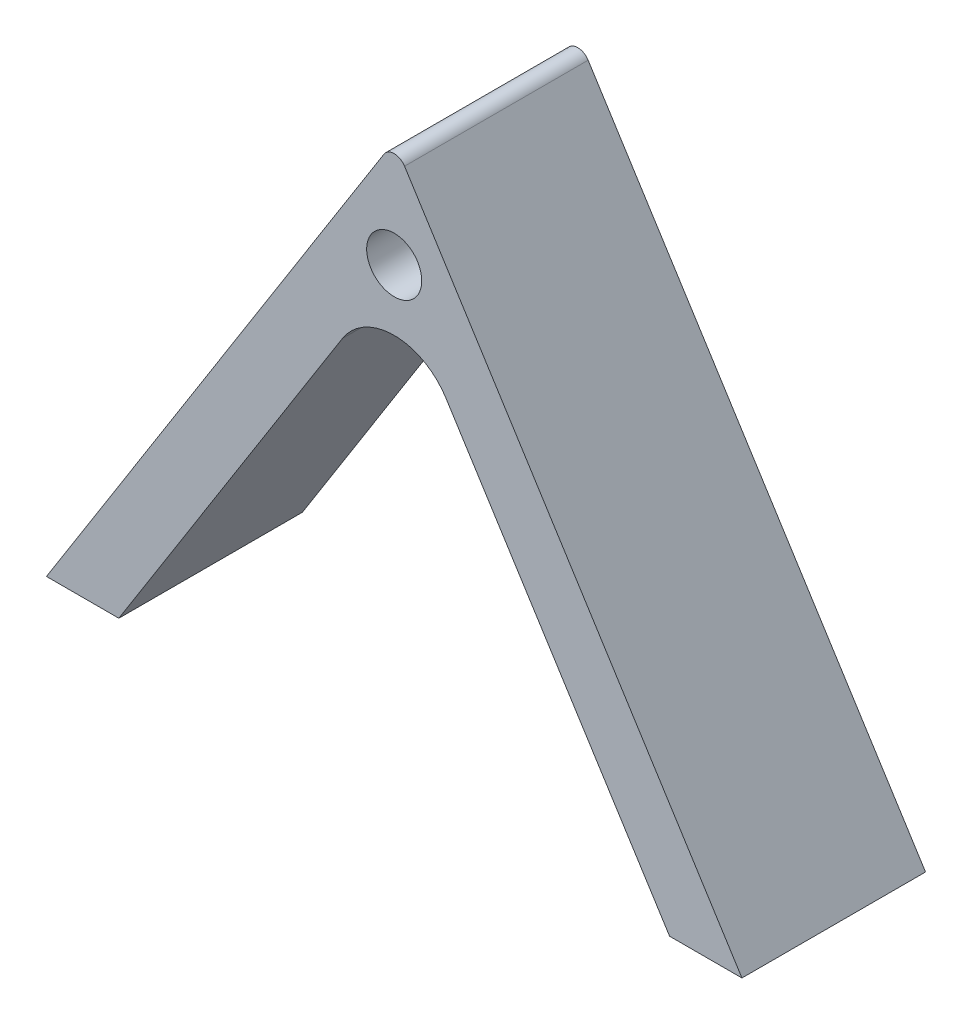
ISO-10303-21;
HEADER;
FILE_DESCRIPTION(('STEP AP214'),'2;1');
FILE_NAME('part.step','',(''),(''),'','','');
FILE_SCHEMA(('AUTOMOTIVE_DESIGN { 1 0 10303 214 1 1 1 1 }'));
ENDSEC;
DATA;
#1=APPLICATION_CONTEXT('core data for automotive mechanical design processes');
#2=APPLICATION_PROTOCOL_DEFINITION('international standard','automotive_design',2000,#1);
#3=PRODUCT_CONTEXT('',#1,'mechanical');
#4=PRODUCT('Part','Part','',(#3));
#5=PRODUCT_RELATED_PRODUCT_CATEGORY('part','',(#4));
#6=PRODUCT_DEFINITION_FORMATION('','',#4);
#7=PRODUCT_DEFINITION_CONTEXT('part definition',#1,'design');
#8=PRODUCT_DEFINITION('design','',#6,#7);
#9=PRODUCT_DEFINITION_SHAPE('','',#8);
#10=(LENGTH_UNIT() NAMED_UNIT(*) SI_UNIT(.MILLI.,.METRE.));
#11=(NAMED_UNIT(*) PLANE_ANGLE_UNIT() SI_UNIT($,.RADIAN.));
#12=(NAMED_UNIT(*) SI_UNIT($,.STERADIAN.) SOLID_ANGLE_UNIT());
#13=UNCERTAINTY_MEASURE_WITH_UNIT(LENGTH_MEASURE(1.E-05),#10,'distance_accuracy_value','');
#14=(GEOMETRIC_REPRESENTATION_CONTEXT(3) GLOBAL_UNCERTAINTY_ASSIGNED_CONTEXT((#13)) GLOBAL_UNIT_ASSIGNED_CONTEXT((#10,
#11,#12)) REPRESENTATION_CONTEXT('',''));
#15=CARTESIAN_POINT('',(0.,0.,0.));
#16=DIRECTION('',(0.,0.,1.));
#17=DIRECTION('',(1.,0.,0.));
#18=AXIS2_PLACEMENT_3D('',#15,#16,#17);
#19=CARTESIAN_POINT('',(-45.,0.,30.));
#20=DIRECTION('',(0.,1.,0.));
#21=DIRECTION('',(-1.,0.,0.));
#22=AXIS2_PLACEMENT_3D('',#19,#20,#21);
#23=PLANE('',#22);
#24=DIRECTION('',(1.,0.,0.));
#25=VECTOR('',#24,1.);
#26=CARTESIAN_POINT('',(-45.,0.,0.));
#27=LINE('',#26,#25);
#28=CARTESIAN_POINT('',(-56.8265537219067,0.,0.));
#29=VERTEX_POINT('',#28);
#30=CARTESIAN_POINT('',(-45.,0.,0.));
#31=VERTEX_POINT('',#30);
#32=EDGE_CURVE('E125',#29,#31,#27,.T.);
#33=ORIENTED_EDGE('',*,*,#32,.T.);
#34=DIRECTION('',(0.,0.,-1.));
#35=VECTOR('',#34,1.);
#36=CARTESIAN_POINT('',(-45.,0.,30.));
#37=LINE('',#36,#35);
#38=CARTESIAN_POINT('',(-45.,0.,30.));
#39=VERTEX_POINT('',#38);
#40=EDGE_CURVE('E105',#39,#31,#37,.T.);
#41=ORIENTED_EDGE('',*,*,#40,.F.);
#42=DIRECTION('',(1.,0.,0.));
#43=VECTOR('',#42,1.);
#44=CARTESIAN_POINT('',(-45.,0.,30.));
#45=LINE('',#44,#43);
#46=CARTESIAN_POINT('',(-56.8265537219067,0.,30.));
#47=VERTEX_POINT('',#46);
#48=EDGE_CURVE('E111',#47,#39,#45,.T.);
#49=ORIENTED_EDGE('',*,*,#48,.F.);
#50=DIRECTION('',(0.,0.,-1.));
#51=VECTOR('',#50,1.);
#52=CARTESIAN_POINT('',(-56.8265537219067,0.,30.));
#53=LINE('',#52,#51);
#54=EDGE_CURVE('E181',#47,#29,#53,.T.);
#55=ORIENTED_EDGE('',*,*,#54,.T.);
#56=EDGE_LOOP('',(#33,#41,#49,#55));
#57=FACE_BOUND('',#56,.T.);
#58=ADVANCED_FACE('F39',(#57),#23,.F.);
#59=CARTESIAN_POINT('',(0.,71.2694987596744,30.));
#60=DIRECTION('',(-0.845554861977812,0.533888542100018,0.));
#61=DIRECTION('',(-0.533888542100018,-0.845554861977813,0.));
#62=AXIS2_PLACEMENT_3D('',#59,#60,#61);
#63=PLANE('',#62);
#64=DIRECTION('',(0.533888542100018,0.845554861977813,0.));
#65=VECTOR('',#64,1.);
#66=CARTESIAN_POINT('',(0.,71.2694987596744,0.));
#67=LINE('',#66,#65);
#68=CARTESIAN_POINT('',(-8.45554861977813,57.877882940349,0.));
#69=VERTEX_POINT('',#68);
#70=EDGE_CURVE('E167',#31,#69,#67,.T.);
#71=ORIENTED_EDGE('',*,*,#70,.T.);
#72=DIRECTION('',(0.,0.,-1.));
#73=VECTOR('',#72,1.);
#74=CARTESIAN_POINT('',(-8.45554861977812,57.877882940349,30.));
#75=LINE('',#74,#73);
#76=CARTESIAN_POINT('',(-8.45554861977813,57.877882940349,30.));
#77=VERTEX_POINT('',#76);
#78=EDGE_CURVE('E55',#69,#77,#75,.F.);
#79=ORIENTED_EDGE('',*,*,#78,.T.);
#80=DIRECTION('',(0.533888542100018,0.845554861977813,0.));
#81=VECTOR('',#80,1.);
#82=CARTESIAN_POINT('',(0.,71.2694987596744,30.));
#83=LINE('',#82,#81);
#84=EDGE_CURVE('E101',#39,#77,#83,.T.);
#85=ORIENTED_EDGE('',*,*,#84,.F.);
#86=ORIENTED_EDGE('',*,*,#40,.T.);
#87=EDGE_LOOP('',(#71,#79,#85,#86));
#88=FACE_BOUND('',#87,.T.);
#89=ADVANCED_FACE('F103',(#88),#63,.F.);
#90=CARTESIAN_POINT('',(45.,0.,30.));
#91=DIRECTION('',(0.845554861977813,0.533888542100018,0.));
#92=DIRECTION('',(-0.533888542100018,0.845554861977813,0.));
#93=AXIS2_PLACEMENT_3D('',#90,#91,#92);
#94=PLANE('',#93);
#95=DIRECTION('',(0.533888542100017,-0.845554861977813,0.));
#96=VECTOR('',#95,1.);
#97=CARTESIAN_POINT('',(45.,0.,30.));
#98=LINE('',#97,#96);
#99=CARTESIAN_POINT('',(8.45554861977812,57.877882940349,30.));
#100=VERTEX_POINT('',#99);
#101=CARTESIAN_POINT('',(45.,0.,30.));
#102=VERTEX_POINT('',#101);
#103=EDGE_CURVE('E110',#100,#102,#98,.T.);
#104=ORIENTED_EDGE('',*,*,#103,.F.);
#105=DIRECTION('',(0.,0.,-1.));
#106=VECTOR('',#105,1.);
#107=CARTESIAN_POINT('',(8.45554861977811,57.877882940349,0.));
#108=LINE('',#107,#106);
#109=CARTESIAN_POINT('',(8.45554861977812,57.877882940349,0.));
#110=VERTEX_POINT('',#109);
#111=EDGE_CURVE('E148',#100,#110,#108,.T.);
#112=ORIENTED_EDGE('',*,*,#111,.T.);
#113=DIRECTION('',(0.533888542100017,-0.845554861977813,0.));
#114=VECTOR('',#113,1.);
#115=CARTESIAN_POINT('',(45.,0.,0.));
#116=LINE('',#115,#114);
#117=CARTESIAN_POINT('',(45.,0.,0.));
#118=VERTEX_POINT('',#117);
#119=EDGE_CURVE('E159',#110,#118,#116,.T.);
#120=ORIENTED_EDGE('',*,*,#119,.T.);
#121=DIRECTION('',(0.,0.,-1.));
#122=VECTOR('',#121,1.);
#123=CARTESIAN_POINT('',(45.,0.,30.));
#124=LINE('',#123,#122);
#125=EDGE_CURVE('E128',#102,#118,#124,.T.);
#126=ORIENTED_EDGE('',*,*,#125,.F.);
#127=EDGE_LOOP('',(#104,#112,#120,#126));
#128=FACE_BOUND('',#127,.T.);
#129=ADVANCED_FACE('F157',(#128),#94,.F.);
#130=CARTESIAN_POINT('',(56.8265537219067,0.,30.));
#131=DIRECTION('',(0.,1.,0.));
#132=DIRECTION('',(-1.,0.,0.));
#133=AXIS2_PLACEMENT_3D('',#130,#131,#132);
#134=PLANE('',#133);
#135=DIRECTION('',(1.,0.,0.));
#136=VECTOR('',#135,1.);
#137=CARTESIAN_POINT('',(56.8265537219067,0.,0.));
#138=LINE('',#137,#136);
#139=CARTESIAN_POINT('',(56.8265537219067,0.,0.));
#140=VERTEX_POINT('',#139);
#141=EDGE_CURVE('E165',#118,#140,#138,.T.);
#142=ORIENTED_EDGE('',*,*,#141,.T.);
#143=DIRECTION('',(0.,0.,-1.));
#144=VECTOR('',#143,1.);
#145=CARTESIAN_POINT('',(56.8265537219067,0.,30.));
#146=LINE('',#145,#144);
#147=CARTESIAN_POINT('',(56.8265537219067,0.,30.));
#148=VERTEX_POINT('',#147);
#149=EDGE_CURVE('E136',#148,#140,#146,.T.);
#150=ORIENTED_EDGE('',*,*,#149,.F.);
#151=DIRECTION('',(1.,0.,0.));
#152=VECTOR('',#151,1.);
#153=CARTESIAN_POINT('',(56.8265537219067,0.,30.));
#154=LINE('',#153,#152);
#155=EDGE_CURVE('E202',#102,#148,#154,.T.);
#156=ORIENTED_EDGE('',*,*,#155,.F.);
#157=ORIENTED_EDGE('',*,*,#125,.T.);
#158=EDGE_LOOP('',(#142,#150,#156,#157));
#159=FACE_BOUND('',#158,.T.);
#160=ADVANCED_FACE('F219',(#159),#134,.F.);
#161=CARTESIAN_POINT('',(0.,90.,30.));
#162=DIRECTION('',(-0.845554861977813,-0.533888542100017,0.));
#163=DIRECTION('',(0.533888542100017,-0.845554861977813,0.));
#164=AXIS2_PLACEMENT_3D('',#161,#162,#163);
#165=PLANE('',#164);
#166=DIRECTION('',(-0.533888542100017,0.845554861977813,0.));
#167=VECTOR('',#166,1.);
#168=CARTESIAN_POINT('',(0.,90.,0.));
#169=LINE('',#168,#167);
#170=CARTESIAN_POINT('',(1.69110972395563,87.3216768361349,0.));
#171=VERTEX_POINT('',#170);
#172=EDGE_CURVE('E171',#140,#171,#169,.T.);
#173=ORIENTED_EDGE('',*,*,#172,.T.);
#174=DIRECTION('',(0.,0.,-1.));
#175=VECTOR('',#174,1.);
#176=CARTESIAN_POINT('',(1.69110972395563,87.3216768361349,30.));
#177=LINE('',#176,#175);
#178=CARTESIAN_POINT('',(1.69110972395563,87.3216768361349,30.));
#179=VERTEX_POINT('',#178);
#180=EDGE_CURVE('E142',#171,#179,#177,.F.);
#181=ORIENTED_EDGE('',*,*,#180,.T.);
#182=DIRECTION('',(-0.533888542100017,0.845554861977813,0.));
#183=VECTOR('',#182,1.);
#184=CARTESIAN_POINT('',(0.,90.,30.));
#185=LINE('',#184,#183);
#186=EDGE_CURVE('E190',#148,#179,#185,.T.);
#187=ORIENTED_EDGE('',*,*,#186,.F.);
#188=ORIENTED_EDGE('',*,*,#149,.T.);
#189=EDGE_LOOP('',(#173,#181,#187,#188));
#190=FACE_BOUND('',#189,.T.);
#191=ADVANCED_FACE('F188',(#190),#165,.F.);
#192=CARTESIAN_POINT('',(-56.8265537219067,0.,30.));
#193=DIRECTION('',(0.845554861977813,-0.533888542100018,0.));
#194=DIRECTION('',(0.533888542100018,0.845554861977813,0.));
#195=AXIS2_PLACEMENT_3D('',#192,#193,#194);
#196=PLANE('',#195);
#197=DIRECTION('',(-0.533888542100018,-0.845554861977813,0.));
#198=VECTOR('',#197,1.);
#199=CARTESIAN_POINT('',(-56.8265537219067,0.,30.));
#200=LINE('',#199,#198);
#201=CARTESIAN_POINT('',(-1.69110972395563,87.3216768361349,30.));
#202=VERTEX_POINT('',#201);
#203=EDGE_CURVE('E117',#202,#47,#200,.T.);
#204=ORIENTED_EDGE('',*,*,#203,.F.);
#205=DIRECTION('',(0.,0.,-1.));
#206=VECTOR('',#205,1.);
#207=CARTESIAN_POINT('',(-1.69110972395563,87.3216768361349,30.));
#208=LINE('',#207,#206);
#209=CARTESIAN_POINT('',(-1.69110972395563,87.3216768361349,0.));
#210=VERTEX_POINT('',#209);
#211=EDGE_CURVE('E127',#202,#210,#208,.T.);
#212=ORIENTED_EDGE('',*,*,#211,.T.);
#213=DIRECTION('',(-0.533888542100018,-0.845554861977813,0.));
#214=VECTOR('',#213,1.);
#215=CARTESIAN_POINT('',(-56.8265537219067,0.,0.));
#216=LINE('',#215,#214);
#217=EDGE_CURVE('E122',#210,#29,#216,.T.);
#218=ORIENTED_EDGE('',*,*,#217,.T.);
#219=ORIENTED_EDGE('',*,*,#54,.F.);
#220=EDGE_LOOP('',(#204,#212,#218,#219));
#221=FACE_BOUND('',#220,.T.);
#222=ADVANCED_FACE('F198',(#221),#196,.F.);
#223=CARTESIAN_POINT('',(0.,0.,30.));
#224=DIRECTION('',(0.,0.,-1.));
#225=DIRECTION('',(-1.,0.,0.));
#226=AXIS2_PLACEMENT_3D('',#223,#224,#225);
#227=PLANE('',#226);
#228=CARTESIAN_POINT('',(0.,72.5,30.));
#229=DIRECTION('',(0.,0.,1.));
#230=DIRECTION('',(1.,0.,0.));
#231=AXIS2_PLACEMENT_3D('',#228,#229,#230);
#232=CIRCLE('',#231,4.5);
#233=CARTESIAN_POINT('',(4.5,72.5,30.));
#234=VERTEX_POINT('',#233);
#235=EDGE_CURVE('E209',#234,#234,#232,.T.);
#236=ORIENTED_EDGE('',*,*,#235,.F.);
#237=EDGE_LOOP('',(#236));
#238=FACE_BOUND('',#237,.T.);
#239=ORIENTED_EDGE('',*,*,#186,.T.);
#240=CARTESIAN_POINT('',(0.,86.2538997519349,30.));
#241=DIRECTION('',(0.,0.,-1.));
#242=DIRECTION('',(-1.,0.,0.));
#243=AXIS2_PLACEMENT_3D('',#240,#241,#242);
#244=CIRCLE('',#243,2.);
#245=EDGE_CURVE('E145',#179,#202,#244,.F.);
#246=ORIENTED_EDGE('',*,*,#245,.T.);
#247=ORIENTED_EDGE('',*,*,#203,.T.);
#248=ORIENTED_EDGE('',*,*,#48,.T.);
#249=ORIENTED_EDGE('',*,*,#84,.T.);
#250=CARTESIAN_POINT('',(0.,52.5389975193488,30.));
#251=DIRECTION('',(0.,0.,-1.));
#252=DIRECTION('',(-1.,0.,0.));
#253=AXIS2_PLACEMENT_3D('',#250,#251,#252);
#254=CIRCLE('',#253,10.);
#255=EDGE_CURVE('E11',#77,#100,#254,.T.);
#256=ORIENTED_EDGE('',*,*,#255,.T.);
#257=ORIENTED_EDGE('',*,*,#103,.T.);
#258=ORIENTED_EDGE('',*,*,#155,.T.);
#259=EDGE_LOOP('',(#239,#246,#247,#248,#249,#256,#257,#258));
#260=FACE_BOUND('',#259,.T.);
#261=ADVANCED_FACE('F115',(#238,#260),#227,.F.);
#262=CARTESIAN_POINT('',(0.,0.,0.));
#263=DIRECTION('',(0.,0.,-1.));
#264=DIRECTION('',(-1.,0.,0.));
#265=AXIS2_PLACEMENT_3D('',#262,#263,#264);
#266=PLANE('',#265);
#267=CARTESIAN_POINT('',(0.,72.5,0.));
#268=DIRECTION('',(0.,0.,1.));
#269=DIRECTION('',(1.,0.,0.));
#270=AXIS2_PLACEMENT_3D('',#267,#268,#269);
#271=CIRCLE('',#270,4.5);
#272=CARTESIAN_POINT('',(4.5,72.5,0.));
#273=VERTEX_POINT('',#272);
#274=EDGE_CURVE('E206',#273,#273,#271,.T.);
#275=ORIENTED_EDGE('',*,*,#274,.T.);
#276=EDGE_LOOP('',(#275));
#277=FACE_BOUND('',#276,.T.);
#278=ORIENTED_EDGE('',*,*,#217,.F.);
#279=CARTESIAN_POINT('',(0.,86.2538997519349,0.));
#280=DIRECTION('',(0.,0.,-1.));
#281=DIRECTION('',(-1.,0.,0.));
#282=AXIS2_PLACEMENT_3D('',#279,#280,#281);
#283=CIRCLE('',#282,2.);
#284=EDGE_CURVE('E133',#210,#171,#283,.T.);
#285=ORIENTED_EDGE('',*,*,#284,.T.);
#286=ORIENTED_EDGE('',*,*,#172,.F.);
#287=ORIENTED_EDGE('',*,*,#141,.F.);
#288=ORIENTED_EDGE('',*,*,#119,.F.);
#289=CARTESIAN_POINT('',(0.,52.5389975193488,0.));
#290=DIRECTION('',(0.,0.,-1.));
#291=DIRECTION('',(-1.,0.,0.));
#292=AXIS2_PLACEMENT_3D('',#289,#290,#291);
#293=CIRCLE('',#292,10.);
#294=EDGE_CURVE('E48',#110,#69,#293,.F.);
#295=ORIENTED_EDGE('',*,*,#294,.T.);
#296=ORIENTED_EDGE('',*,*,#70,.F.);
#297=ORIENTED_EDGE('',*,*,#32,.F.);
#298=EDGE_LOOP('',(#278,#285,#286,#287,#288,#295,#296,#297));
#299=FACE_BOUND('',#298,.T.);
#300=ADVANCED_FACE('F163',(#277,#299),#266,.T.);
#301=CARTESIAN_POINT('',(0.,86.2538997519349,30.));
#302=DIRECTION('',(0.,0.,-1.));
#303=DIRECTION('',(-1.,0.,0.));
#304=AXIS2_PLACEMENT_3D('',#301,#302,#303);
#305=CYLINDRICAL_SURFACE('',#304,2.);
#306=ORIENTED_EDGE('',*,*,#245,.F.);
#307=ORIENTED_EDGE('',*,*,#180,.F.);
#308=ORIENTED_EDGE('',*,*,#284,.F.);
#309=ORIENTED_EDGE('',*,*,#211,.F.);
#310=EDGE_LOOP('',(#306,#307,#308,#309));
#311=FACE_BOUND('',#310,.T.);
#312=ADVANCED_FACE('F196',(#311),#305,.T.);
#313=CARTESIAN_POINT('',(0.,52.5389975193488,30.));
#314=DIRECTION('',(0.,0.,1.));
#315=DIRECTION('',(1.,0.,0.));
#316=AXIS2_PLACEMENT_3D('',#313,#314,#315);
#317=CYLINDRICAL_SURFACE('',#316,10.);
#318=ORIENTED_EDGE('',*,*,#255,.F.);
#319=ORIENTED_EDGE('',*,*,#78,.F.);
#320=ORIENTED_EDGE('',*,*,#294,.F.);
#321=ORIENTED_EDGE('',*,*,#111,.F.);
#322=EDGE_LOOP('',(#318,#319,#320,#321));
#323=FACE_BOUND('',#322,.T.);
#324=ADVANCED_FACE('F41',(#323),#317,.F.);
#325=CARTESIAN_POINT('',(0.,72.5,0.));
#326=DIRECTION('',(0.,0.,1.));
#327=DIRECTION('',(1.,0.,0.));
#328=AXIS2_PLACEMENT_3D('',#325,#326,#327);
#329=CYLINDRICAL_SURFACE('',#328,4.5);
#330=ORIENTED_EDGE('',*,*,#274,.F.);
#331=EDGE_LOOP('',(#330));
#332=FACE_BOUND('',#331,.T.);
#333=ORIENTED_EDGE('',*,*,#235,.T.);
#334=EDGE_LOOP('',(#333));
#335=FACE_BOUND('',#334,.T.);
#336=ADVANCED_FACE('F239',(#332,#335),#329,.F.);
#337=CLOSED_SHELL('',(#58,#89,#129,#160,#191,#222,#261,#300,#312,#324,#336));
#338=MANIFOLD_SOLID_BREP('B2',#337);
#339=ADVANCED_BREP_SHAPE_REPRESENTATION('',(#18,#338),#14);
#340=SHAPE_DEFINITION_REPRESENTATION(#9,#339);
ENDSEC;
END-ISO-10303-21;
